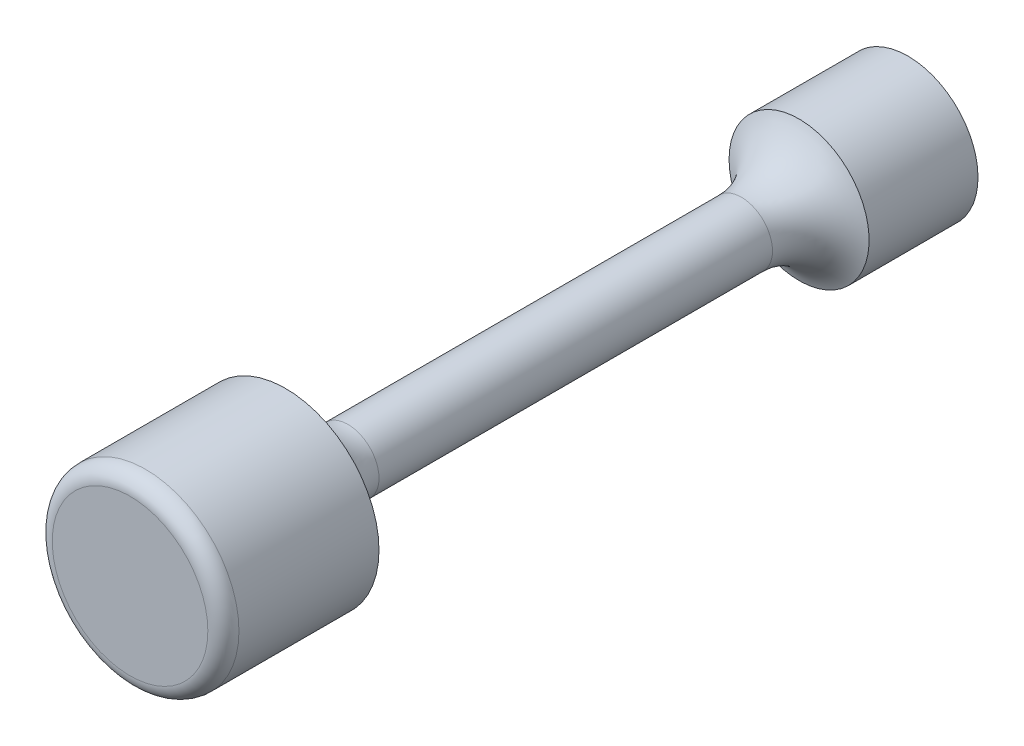
ISO-10303-21;
HEADER;
FILE_DESCRIPTION(('STEP AP214'),'2;1');
FILE_NAME('part.step','',(''),(''),'','','');
FILE_SCHEMA(('AUTOMOTIVE_DESIGN { 1 0 10303 214 1 1 1 1 }'));
ENDSEC;
DATA;
#1=APPLICATION_CONTEXT('core data for automotive mechanical design processes');
#2=APPLICATION_PROTOCOL_DEFINITION('international standard','automotive_design',2000,#1);
#3=PRODUCT_CONTEXT('',#1,'mechanical');
#4=PRODUCT('Part','Part','',(#3));
#5=PRODUCT_RELATED_PRODUCT_CATEGORY('part','',(#4));
#6=PRODUCT_DEFINITION_FORMATION('','',#4);
#7=PRODUCT_DEFINITION_CONTEXT('part definition',#1,'design');
#8=PRODUCT_DEFINITION('design','',#6,#7);
#9=PRODUCT_DEFINITION_SHAPE('','',#8);
#10=(LENGTH_UNIT() NAMED_UNIT(*) SI_UNIT(.MILLI.,.METRE.));
#11=(NAMED_UNIT(*) PLANE_ANGLE_UNIT() SI_UNIT($,.RADIAN.));
#12=(NAMED_UNIT(*) SI_UNIT($,.STERADIAN.) SOLID_ANGLE_UNIT());
#13=UNCERTAINTY_MEASURE_WITH_UNIT(LENGTH_MEASURE(1.E-05),#10,'distance_accuracy_value','');
#14=(GEOMETRIC_REPRESENTATION_CONTEXT(3) GLOBAL_UNCERTAINTY_ASSIGNED_CONTEXT((#13)) GLOBAL_UNIT_ASSIGNED_CONTEXT((#10,
#11,#12)) REPRESENTATION_CONTEXT('',''));
#15=CARTESIAN_POINT('',(0.,0.,0.));
#16=DIRECTION('',(0.,0.,1.));
#17=DIRECTION('',(1.,0.,0.));
#18=AXIS2_PLACEMENT_3D('',#15,#16,#17);
#19=CARTESIAN_POINT('',(0.,0.,20.));
#20=DIRECTION('',(0.,0.,-1.));
#21=DIRECTION('',(-1.,0.,0.));
#22=AXIS2_PLACEMENT_3D('',#19,#20,#21);
#23=CYLINDRICAL_SURFACE('',#22,2.25);
#24=CARTESIAN_POINT('',(0.,0.,3.5));
#25=DIRECTION('',(0.,0.,-1.));
#26=DIRECTION('',(-1.,0.,0.));
#27=AXIS2_PLACEMENT_3D('',#24,#25,#26);
#28=CIRCLE('',#27,2.25);
#29=CARTESIAN_POINT('',(-2.25,0.,3.5));
#30=VERTEX_POINT('',#29);
#31=EDGE_CURVE('E140',#30,#30,#28,.T.);
#32=ORIENTED_EDGE('',*,*,#31,.T.);
#33=EDGE_LOOP('',(#32));
#34=FACE_BOUND('',#33,.T.);
#35=CARTESIAN_POINT('',(0.,0.,0.));
#36=DIRECTION('',(0.,0.,1.));
#37=DIRECTION('',(1.,0.,0.));
#38=AXIS2_PLACEMENT_3D('',#35,#36,#37);
#39=CIRCLE('',#38,2.25);
#40=CARTESIAN_POINT('',(2.25,0.,0.));
#41=VERTEX_POINT('',#40);
#42=EDGE_CURVE('E131',#41,#41,#39,.T.);
#43=ORIENTED_EDGE('',*,*,#42,.T.);
#44=EDGE_LOOP('',(#43));
#45=FACE_BOUND('',#44,.T.);
#46=ADVANCED_FACE('F42',(#34,#45),#23,.T.);
#47=CARTESIAN_POINT('',(0.,0.,0.));
#48=DIRECTION('',(0.,0.,1.));
#49=DIRECTION('',(1.,0.,0.));
#50=AXIS2_PLACEMENT_3D('',#47,#48,#49);
#51=PLANE('',#50);
#52=DIRECTION('',(-1.,0.,0.));
#53=VECTOR('',#52,1.);
#54=CARTESIAN_POINT('',(0.,-1.2,0.));
#55=LINE('',#54,#53);
#56=CARTESIAN_POINT('',(1.2,-1.2,0.));
#57=VERTEX_POINT('',#56);
#58=CARTESIAN_POINT('',(-1.2,-1.2,0.));
#59=VERTEX_POINT('',#58);
#60=EDGE_CURVE('E93',#57,#59,#55,.T.);
#61=ORIENTED_EDGE('',*,*,#60,.F.);
#62=DIRECTION('',(0.,-1.,0.));
#63=VECTOR('',#62,1.);
#64=CARTESIAN_POINT('',(1.2,0.,0.));
#65=LINE('',#64,#63);
#66=CARTESIAN_POINT('',(1.2,1.2,0.));
#67=VERTEX_POINT('',#66);
#68=EDGE_CURVE('E58',#67,#57,#65,.T.);
#69=ORIENTED_EDGE('',*,*,#68,.F.);
#70=DIRECTION('',(1.,0.,0.));
#71=VECTOR('',#70,1.);
#72=CARTESIAN_POINT('',(0.,1.2,0.));
#73=LINE('',#72,#71);
#74=CARTESIAN_POINT('',(-1.2,1.2,0.));
#75=VERTEX_POINT('',#74);
#76=EDGE_CURVE('E113',#75,#67,#73,.T.);
#77=ORIENTED_EDGE('',*,*,#76,.F.);
#78=DIRECTION('',(0.,1.,0.));
#79=VECTOR('',#78,1.);
#80=CARTESIAN_POINT('',(-1.2,0.,0.));
#81=LINE('',#80,#79);
#82=EDGE_CURVE('E124',#59,#75,#81,.T.);
#83=ORIENTED_EDGE('',*,*,#82,.F.);
#84=EDGE_LOOP('',(#61,#69,#77,#83));
#85=FACE_BOUND('',#84,.T.);
#86=ORIENTED_EDGE('',*,*,#42,.F.);
#87=EDGE_LOOP('',(#86));
#88=FACE_BOUND('',#87,.T.);
#89=ADVANCED_FACE('F166',(#85,#88),#51,.F.);
#90=CARTESIAN_POINT('',(1.2,0.,2.5));
#91=DIRECTION('',(1.,0.,0.));
#92=DIRECTION('',(0.,0.,-1.));
#93=AXIS2_PLACEMENT_3D('',#90,#91,#92);
#94=PLANE('',#93);
#95=ORIENTED_EDGE('',*,*,#68,.T.);
#96=DIRECTION('',(0.,0.,-1.));
#97=VECTOR('',#96,1.);
#98=CARTESIAN_POINT('',(1.2,-1.2,2.5));
#99=LINE('',#98,#97);
#100=CARTESIAN_POINT('',(1.2,-1.2,2.5));
#101=VERTEX_POINT('',#100);
#102=EDGE_CURVE('E81',#101,#57,#99,.T.);
#103=ORIENTED_EDGE('',*,*,#102,.F.);
#104=DIRECTION('',(0.,-1.,0.));
#105=VECTOR('',#104,1.);
#106=CARTESIAN_POINT('',(1.2,0.,2.5));
#107=LINE('',#106,#105);
#108=CARTESIAN_POINT('',(1.2,1.2,2.5));
#109=VERTEX_POINT('',#108);
#110=EDGE_CURVE('E109',#109,#101,#107,.T.);
#111=ORIENTED_EDGE('',*,*,#110,.F.);
#112=DIRECTION('',(0.,0.,-1.));
#113=VECTOR('',#112,1.);
#114=CARTESIAN_POINT('',(1.2,1.2,2.5));
#115=LINE('',#114,#113);
#116=EDGE_CURVE('E66',#109,#67,#115,.T.);
#117=ORIENTED_EDGE('',*,*,#116,.T.);
#118=EDGE_LOOP('',(#95,#103,#111,#117));
#119=FACE_BOUND('',#118,.T.);
#120=ADVANCED_FACE('F172',(#119),#94,.F.);
#121=CARTESIAN_POINT('',(0.,1.2,2.5));
#122=DIRECTION('',(0.,1.,0.));
#123=DIRECTION('',(-1.,0.,0.));
#124=AXIS2_PLACEMENT_3D('',#121,#122,#123);
#125=PLANE('',#124);
#126=ORIENTED_EDGE('',*,*,#76,.T.);
#127=ORIENTED_EDGE('',*,*,#116,.F.);
#128=DIRECTION('',(1.,0.,0.));
#129=VECTOR('',#128,1.);
#130=CARTESIAN_POINT('',(0.,1.2,2.5));
#131=LINE('',#130,#129);
#132=CARTESIAN_POINT('',(-1.2,1.2,2.5));
#133=VERTEX_POINT('',#132);
#134=EDGE_CURVE('E106',#133,#109,#131,.T.);
#135=ORIENTED_EDGE('',*,*,#134,.F.);
#136=DIRECTION('',(0.,0.,-1.));
#137=VECTOR('',#136,1.);
#138=CARTESIAN_POINT('',(-1.2,1.2,2.5));
#139=LINE('',#138,#137);
#140=EDGE_CURVE('E98',#133,#75,#139,.T.);
#141=ORIENTED_EDGE('',*,*,#140,.T.);
#142=EDGE_LOOP('',(#126,#127,#135,#141));
#143=FACE_BOUND('',#142,.T.);
#144=ADVANCED_FACE('F207',(#143),#125,.F.);
#145=CARTESIAN_POINT('',(-1.2,0.,2.5));
#146=DIRECTION('',(-1.,0.,0.));
#147=DIRECTION('',(0.,0.,1.));
#148=AXIS2_PLACEMENT_3D('',#145,#146,#147);
#149=PLANE('',#148);
#150=ORIENTED_EDGE('',*,*,#82,.T.);
#151=ORIENTED_EDGE('',*,*,#140,.F.);
#152=DIRECTION('',(0.,1.,0.));
#153=VECTOR('',#152,1.);
#154=CARTESIAN_POINT('',(-1.2,0.,2.5));
#155=LINE('',#154,#153);
#156=CARTESIAN_POINT('',(-1.2,-1.2,2.5));
#157=VERTEX_POINT('',#156);
#158=EDGE_CURVE('E101',#157,#133,#155,.T.);
#159=ORIENTED_EDGE('',*,*,#158,.F.);
#160=DIRECTION('',(0.,0.,-1.));
#161=VECTOR('',#160,1.);
#162=CARTESIAN_POINT('',(-1.2,-1.2,2.5));
#163=LINE('',#162,#161);
#164=EDGE_CURVE('E86',#157,#59,#163,.T.);
#165=ORIENTED_EDGE('',*,*,#164,.T.);
#166=EDGE_LOOP('',(#150,#151,#159,#165));
#167=FACE_BOUND('',#166,.T.);
#168=ADVANCED_FACE('F102',(#167),#149,.F.);
#169=CARTESIAN_POINT('',(0.,-1.2,2.5));
#170=DIRECTION('',(0.,-1.,0.));
#171=DIRECTION('',(1.,0.,0.));
#172=AXIS2_PLACEMENT_3D('',#169,#170,#171);
#173=PLANE('',#172);
#174=ORIENTED_EDGE('',*,*,#60,.T.);
#175=ORIENTED_EDGE('',*,*,#164,.F.);
#176=DIRECTION('',(-1.,0.,0.));
#177=VECTOR('',#176,1.);
#178=CARTESIAN_POINT('',(0.,-1.2,2.5));
#179=LINE('',#178,#177);
#180=EDGE_CURVE('E90',#101,#157,#179,.T.);
#181=ORIENTED_EDGE('',*,*,#180,.F.);
#182=ORIENTED_EDGE('',*,*,#102,.T.);
#183=EDGE_LOOP('',(#174,#175,#181,#182));
#184=FACE_BOUND('',#183,.T.);
#185=ADVANCED_FACE('F88',(#184),#173,.F.);
#186=CARTESIAN_POINT('',(0.,0.,2.5));
#187=DIRECTION('',(0.,0.,-1.));
#188=DIRECTION('',(-1.,0.,0.));
#189=AXIS2_PLACEMENT_3D('',#186,#187,#188);
#190=PLANE('',#189);
#191=ORIENTED_EDGE('',*,*,#110,.T.);
#192=ORIENTED_EDGE('',*,*,#180,.T.);
#193=ORIENTED_EDGE('',*,*,#158,.T.);
#194=ORIENTED_EDGE('',*,*,#134,.T.);
#195=EDGE_LOOP('',(#191,#192,#193,#194));
#196=FACE_BOUND('',#195,.T.);
#197=ADVANCED_FACE('F108',(#196),#190,.T.);
#198=CARTESIAN_POINT('',(0.,0.,3.5));
#199=DIRECTION('',(0.,0.,1.));
#200=DIRECTION('',(1.,0.,0.));
#201=AXIS2_PLACEMENT_3D('',#198,#199,#200);
#202=CYLINDRICAL_SURFACE('',#201,1.);
#203=CARTESIAN_POINT('',(0.,0.,5.35404962177391));
#204=DIRECTION('',(0.,0.,-1.));
#205=DIRECTION('',(-1.,0.,0.));
#206=AXIS2_PLACEMENT_3D('',#203,#204,#205);
#207=CIRCLE('',#206,1.);
#208=CARTESIAN_POINT('',(-1.,0.,5.35404962177391));
#209=VERTEX_POINT('',#208);
#210=EDGE_CURVE('E147',#209,#209,#207,.F.);
#211=ORIENTED_EDGE('',*,*,#210,.T.);
#212=EDGE_LOOP('',(#211));
#213=FACE_BOUND('',#212,.T.);
#214=CARTESIAN_POINT('',(0.,0.,18.));
#215=DIRECTION('',(0.,0.,1.));
#216=DIRECTION('',(1.,0.,0.));
#217=AXIS2_PLACEMENT_3D('',#214,#215,#216);
#218=CIRCLE('',#217,1.);
#219=CARTESIAN_POINT('',(1.,0.,18.));
#220=VERTEX_POINT('',#219);
#221=EDGE_CURVE('E139',#220,#220,#218,.F.);
#222=ORIENTED_EDGE('',*,*,#221,.T.);
#223=EDGE_LOOP('',(#222));
#224=FACE_BOUND('',#223,.T.);
#225=ADVANCED_FACE('F190',(#213,#224),#202,.T.);
#226=CARTESIAN_POINT('',(0.,0.,25.));
#227=DIRECTION('',(0.,0.,1.));
#228=DIRECTION('',(1.,0.,0.));
#229=AXIS2_PLACEMENT_3D('',#226,#227,#228);
#230=PLANE('',#229);
#231=CARTESIAN_POINT('',(0.,0.,25.));
#232=DIRECTION('',(0.,0.,1.));
#233=DIRECTION('',(1.,0.,0.));
#234=AXIS2_PLACEMENT_3D('',#231,#232,#233);
#235=CIRCLE('',#234,2.5);
#236=CARTESIAN_POINT('',(2.5,0.,25.));
#237=VERTEX_POINT('',#236);
#238=EDGE_CURVE('E51',#237,#237,#235,.T.);
#239=ORIENTED_EDGE('',*,*,#238,.T.);
#240=EDGE_LOOP('',(#239));
#241=FACE_BOUND('',#240,.T.);
#242=ADVANCED_FACE('F154',(#241),#230,.T.);
#243=CARTESIAN_POINT('',(0.,0.,25.));
#244=DIRECTION('',(0.,0.,-1.));
#245=DIRECTION('',(-1.,0.,0.));
#246=AXIS2_PLACEMENT_3D('',#243,#244,#245);
#247=CYLINDRICAL_SURFACE('',#246,3.);
#248=CARTESIAN_POINT('',(0.,0.,24.5));
#249=DIRECTION('',(0.,0.,1.));
#250=DIRECTION('',(1.,0.,0.));
#251=AXIS2_PLACEMENT_3D('',#248,#249,#250);
#252=CIRCLE('',#251,3.);
#253=CARTESIAN_POINT('',(3.,0.,24.5));
#254=VERTEX_POINT('',#253);
#255=EDGE_CURVE('E12',#254,#254,#252,.F.);
#256=ORIENTED_EDGE('',*,*,#255,.T.);
#257=EDGE_LOOP('',(#256));
#258=FACE_BOUND('',#257,.T.);
#259=CARTESIAN_POINT('',(0.,0.,20.));
#260=DIRECTION('',(0.,0.,1.));
#261=DIRECTION('',(1.,0.,0.));
#262=AXIS2_PLACEMENT_3D('',#259,#260,#261);
#263=CIRCLE('',#262,3.);
#264=CARTESIAN_POINT('',(3.,0.,20.));
#265=VERTEX_POINT('',#264);
#266=EDGE_CURVE('E121',#265,#265,#263,.T.);
#267=ORIENTED_EDGE('',*,*,#266,.T.);
#268=EDGE_LOOP('',(#267));
#269=FACE_BOUND('',#268,.T.);
#270=ADVANCED_FACE('F179',(#258,#269),#247,.T.);
#271=CARTESIAN_POINT('',(0.,0.,5.35404962177391));
#272=DIRECTION('',(0.,0.,-1.));
#273=DIRECTION('',(-1.,0.,0.));
#274=AXIS2_PLACEMENT_3D('',#271,#272,#273);
#275=TOROIDAL_SURFACE('',#274,3.,2.);
#276=ORIENTED_EDGE('',*,*,#31,.F.);
#277=EDGE_LOOP('',(#276));
#278=FACE_BOUND('',#277,.T.);
#279=ORIENTED_EDGE('',*,*,#210,.F.);
#280=EDGE_LOOP('',(#279));
#281=FACE_BOUND('',#280,.T.);
#282=ADVANCED_FACE('F162',(#278,#281),#275,.F.);
#283=CARTESIAN_POINT('',(0.,0.,18.));
#284=DIRECTION('',(0.,0.,1.));
#285=DIRECTION('',(1.,0.,0.));
#286=AXIS2_PLACEMENT_3D('',#283,#284,#285);
#287=TOROIDAL_SURFACE('',#286,3.,2.);
#288=ORIENTED_EDGE('',*,*,#221,.F.);
#289=EDGE_LOOP('',(#288));
#290=FACE_BOUND('',#289,.T.);
#291=ORIENTED_EDGE('',*,*,#266,.F.);
#292=EDGE_LOOP('',(#291));
#293=FACE_BOUND('',#292,.T.);
#294=ADVANCED_FACE('F157',(#290,#293),#287,.F.);
#295=CARTESIAN_POINT('',(0.,0.,24.5));
#296=DIRECTION('',(0.,0.,1.));
#297=DIRECTION('',(1.,0.,0.));
#298=AXIS2_PLACEMENT_3D('',#295,#296,#297);
#299=TOROIDAL_SURFACE('',#298,2.5,0.5);
#300=ORIENTED_EDGE('',*,*,#255,.F.);
#301=EDGE_LOOP('',(#300));
#302=FACE_BOUND('',#301,.T.);
#303=ORIENTED_EDGE('',*,*,#238,.F.);
#304=EDGE_LOOP('',(#303));
#305=FACE_BOUND('',#304,.T.);
#306=ADVANCED_FACE('F44',(#302,#305),#299,.T.);
#307=CLOSED_SHELL('',(#46,#89,#120,#144,#168,#185,#197,#225,#242,#270,#282,#294,#306));
#308=MANIFOLD_SOLID_BREP('B2',#307);
#309=ADVANCED_BREP_SHAPE_REPRESENTATION('',(#18,#308),#14);
#310=SHAPE_DEFINITION_REPRESENTATION(#9,#309);
ENDSEC;
END-ISO-10303-21;
